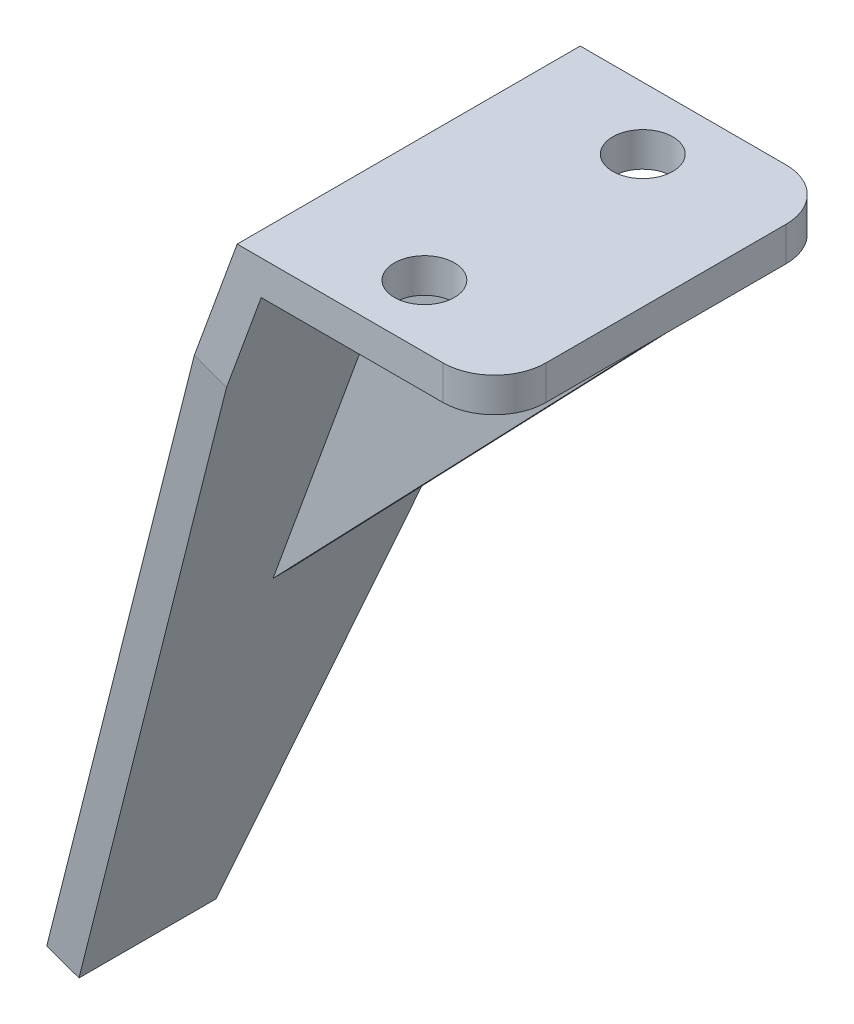
ISO-10303-21;
HEADER;
FILE_DESCRIPTION(('STEP AP214'),'2;1');
FILE_NAME('part.step','',(''),(''),'','','');
FILE_SCHEMA(('AUTOMOTIVE_DESIGN { 1 0 10303 214 1 1 1 1 }'));
ENDSEC;
DATA;
#1=APPLICATION_CONTEXT('core data for automotive mechanical design processes');
#2=APPLICATION_PROTOCOL_DEFINITION('international standard','automotive_design',2000,#1);
#3=PRODUCT_CONTEXT('',#1,'mechanical');
#4=PRODUCT('Part','Part','',(#3));
#5=PRODUCT_RELATED_PRODUCT_CATEGORY('part','',(#4));
#6=PRODUCT_DEFINITION_FORMATION('','',#4);
#7=PRODUCT_DEFINITION_CONTEXT('part definition',#1,'design');
#8=PRODUCT_DEFINITION('design','',#6,#7);
#9=PRODUCT_DEFINITION_SHAPE('','',#8);
#10=(LENGTH_UNIT() NAMED_UNIT(*) SI_UNIT(.MILLI.,.METRE.));
#11=(NAMED_UNIT(*) PLANE_ANGLE_UNIT() SI_UNIT($,.RADIAN.));
#12=(NAMED_UNIT(*) SI_UNIT($,.STERADIAN.) SOLID_ANGLE_UNIT());
#13=UNCERTAINTY_MEASURE_WITH_UNIT(LENGTH_MEASURE(1.E-05),#10,'distance_accuracy_value','');
#14=(GEOMETRIC_REPRESENTATION_CONTEXT(3) GLOBAL_UNCERTAINTY_ASSIGNED_CONTEXT((#13)) GLOBAL_UNIT_ASSIGNED_CONTEXT((#10,
#11,#12)) REPRESENTATION_CONTEXT('',''));
#15=CARTESIAN_POINT('',(0.,0.,0.));
#16=DIRECTION('',(0.,0.,1.));
#17=DIRECTION('',(1.,0.,0.));
#18=AXIS2_PLACEMENT_3D('',#15,#16,#17);
#19=CARTESIAN_POINT('',(22.7189077096569,22.1728559825543,10.));
#20=DIRECTION('',(0.,1.,0.));
#21=DIRECTION('',(0.,0.,1.));
#22=AXIS2_PLACEMENT_3D('',#19,#20,#21);
#23=PLANE('',#22);
#24=CARTESIAN_POINT('',(15.,22.1728559825543,-6.365));
#25=DIRECTION('',(0.,1.,0.));
#26=DIRECTION('',(0.,0.,1.));
#27=AXIS2_PLACEMENT_3D('',#24,#25,#26);
#28=CIRCLE('',#27,1.75);
#29=CARTESIAN_POINT('',(15.,22.1728559825543,-4.615));
#30=VERTEX_POINT('',#29);
#31=EDGE_CURVE('E175',#30,#30,#28,.T.);
#32=ORIENTED_EDGE('',*,*,#31,.T.);
#33=EDGE_LOOP('',(#32));
#34=FACE_BOUND('',#33,.T.);
#35=DIRECTION('',(1.,0.,0.));
#36=VECTOR('',#35,1.);
#37=CARTESIAN_POINT('',(22.7189077096569,22.1728559825543,-10.));
#38=LINE('',#37,#36);
#39=CARTESIAN_POINT('',(9.11932278607632,22.1728559825543,-10.));
#40=VERTEX_POINT('',#39);
#41=CARTESIAN_POINT('',(19.7189077096569,22.1728559825543,-10.));
#42=VERTEX_POINT('',#41);
#43=EDGE_CURVE('E193',#40,#42,#38,.T.);
#44=ORIENTED_EDGE('',*,*,#43,.T.);
#45=CARTESIAN_POINT('',(19.7189077096569,22.1728559825543,-7.));
#46=DIRECTION('',(0.,1.,0.));
#47=DIRECTION('',(0.,0.,1.));
#48=AXIS2_PLACEMENT_3D('',#45,#46,#47);
#49=CIRCLE('',#48,3.);
#50=CARTESIAN_POINT('',(22.7189077096569,22.1728559825543,-7.));
#51=VERTEX_POINT('',#50);
#52=EDGE_CURVE('E11',#42,#51,#49,.F.);
#53=ORIENTED_EDGE('',*,*,#52,.T.);
#54=DIRECTION('',(0.,0.,-1.));
#55=VECTOR('',#54,1.);
#56=CARTESIAN_POINT('',(22.7189077096569,22.1728559825543,10.));
#57=LINE('',#56,#55);
#58=CARTESIAN_POINT('',(22.7189077096569,22.1728559825543,0.));
#59=VERTEX_POINT('',#58);
#60=EDGE_CURVE('E144',#59,#51,#57,.T.);
#61=ORIENTED_EDGE('',*,*,#60,.F.);
#62=DIRECTION('',(-1.,0.,0.));
#63=VECTOR('',#62,1.);
#64=CARTESIAN_POINT('',(9.11932278607632,22.1728559825543,0.));
#65=LINE('',#64,#63);
#66=CARTESIAN_POINT('',(9.11932278607632,22.1728559825543,0.));
#67=VERTEX_POINT('',#66);
#68=EDGE_CURVE('E158',#59,#67,#65,.T.);
#69=ORIENTED_EDGE('',*,*,#68,.T.);
#70=DIRECTION('',(0.,0.,-1.));
#71=VECTOR('',#70,1.);
#72=CARTESIAN_POINT('',(9.11932278607632,22.1728559825543,10.));
#73=LINE('',#72,#71);
#74=EDGE_CURVE('E215',#67,#40,#73,.T.);
#75=ORIENTED_EDGE('',*,*,#74,.T.);
#76=EDGE_LOOP('',(#44,#53,#61,#69,#75));
#77=FACE_BOUND('',#76,.T.);
#78=ADVANCED_FACE('F45',(#34,#77),#23,.F.);
#79=CARTESIAN_POINT('',(22.7189077096569,24.1728559825543,10.));
#80=DIRECTION('',(-1.,0.,0.));
#81=DIRECTION('',(0.,0.,1.));
#82=AXIS2_PLACEMENT_3D('',#79,#80,#81);
#83=PLANE('',#82);
#84=DIRECTION('',(0.,0.,-1.));
#85=VECTOR('',#84,1.);
#86=CARTESIAN_POINT('',(22.7189077096569,24.1728559825543,10.));
#87=LINE('',#86,#85);
#88=CARTESIAN_POINT('',(22.7189077096569,24.1728559825543,7.));
#89=VERTEX_POINT('',#88);
#90=CARTESIAN_POINT('',(22.7189077096569,24.1728559825543,-7.));
#91=VERTEX_POINT('',#90);
#92=EDGE_CURVE('E232',#89,#91,#87,.T.);
#93=ORIENTED_EDGE('',*,*,#92,.F.);
#94=DIRECTION('',(0.,1.,0.));
#95=VECTOR('',#94,1.);
#96=CARTESIAN_POINT('',(22.7189077096569,24.1728559825543,7.));
#97=LINE('',#96,#95);
#98=CARTESIAN_POINT('',(22.7189077096569,22.1728559825543,7.));
#99=VERTEX_POINT('',#98);
#100=EDGE_CURVE('E279',#89,#99,#97,.F.);
#101=ORIENTED_EDGE('',*,*,#100,.T.);
#102=CARTESIAN_POINT('',(22.7189077096569,22.1728559825543,0.999999999999999));
#103=VERTEX_POINT('',#102);
#104=EDGE_CURVE('E147',#99,#103,#57,.T.);
#105=ORIENTED_EDGE('',*,*,#104,.T.);
#106=DIRECTION('',(0.,0.,-1.));
#107=VECTOR('',#106,1.);
#108=CARTESIAN_POINT('',(22.7189077096569,22.1728559825543,1.));
#109=LINE('',#108,#107);
#110=EDGE_CURVE('E140',#103,#59,#109,.T.);
#111=ORIENTED_EDGE('',*,*,#110,.T.);
#112=ORIENTED_EDGE('',*,*,#60,.T.);
#113=DIRECTION('',(0.,1.,0.));
#114=VECTOR('',#113,1.);
#115=CARTESIAN_POINT('',(22.7189077096569,24.1728559825543,-7.));
#116=LINE('',#115,#114);
#117=EDGE_CURVE('E276',#51,#91,#116,.T.);
#118=ORIENTED_EDGE('',*,*,#117,.T.);
#119=EDGE_LOOP('',(#93,#101,#105,#111,#112,#118));
#120=FACE_BOUND('',#119,.T.);
#121=ADVANCED_FACE('F142',(#120),#83,.F.);
#122=CARTESIAN_POINT('',(7.71890770965689,24.1728559825543,10.));
#123=DIRECTION('',(0.,-1.,0.));
#124=DIRECTION('',(1.,0.,0.));
#125=AXIS2_PLACEMENT_3D('',#122,#123,#124);
#126=PLANE('',#125);
#127=CARTESIAN_POINT('',(15.,24.1728559825543,-6.365));
#128=DIRECTION('',(0.,1.,0.));
#129=DIRECTION('',(-1.,0.,0.));
#130=AXIS2_PLACEMENT_3D('',#127,#128,#129);
#131=CIRCLE('',#130,1.75);
#132=CARTESIAN_POINT('',(13.25,24.1728559825543,-6.365));
#133=VERTEX_POINT('',#132);
#134=EDGE_CURVE('E266',#133,#133,#131,.T.);
#135=ORIENTED_EDGE('',*,*,#134,.F.);
#136=EDGE_LOOP('',(#135));
#137=FACE_BOUND('',#136,.T.);
#138=CARTESIAN_POINT('',(15.,24.1728559825543,6.365));
#139=DIRECTION('',(0.,1.,0.));
#140=DIRECTION('',(-1.,0.,0.));
#141=AXIS2_PLACEMENT_3D('',#138,#139,#140);
#142=CIRCLE('',#141,1.75);
#143=CARTESIAN_POINT('',(13.25,24.1728559825543,6.365));
#144=VERTEX_POINT('',#143);
#145=EDGE_CURVE('E296',#144,#144,#142,.T.);
#146=ORIENTED_EDGE('',*,*,#145,.F.);
#147=EDGE_LOOP('',(#146));
#148=FACE_BOUND('',#147,.T.);
#149=DIRECTION('',(-1.,0.,0.));
#150=VECTOR('',#149,1.);
#151=CARTESIAN_POINT('',(7.71890770965689,24.1728559825543,10.));
#152=LINE('',#151,#150);
#153=CARTESIAN_POINT('',(19.7189077096569,24.1728559825543,10.));
#154=VERTEX_POINT('',#153);
#155=CARTESIAN_POINT('',(7.71890770965689,24.1728559825543,10.));
#156=VERTEX_POINT('',#155);
#157=EDGE_CURVE('E189',#154,#156,#152,.T.);
#158=ORIENTED_EDGE('',*,*,#157,.F.);
#159=CARTESIAN_POINT('',(19.7189077096569,24.1728559825543,7.));
#160=DIRECTION('',(0.,-1.,0.));
#161=DIRECTION('',(1.,0.,0.));
#162=AXIS2_PLACEMENT_3D('',#159,#160,#161);
#163=CIRCLE('',#162,3.);
#164=EDGE_CURVE('E273',#154,#89,#163,.F.);
#165=ORIENTED_EDGE('',*,*,#164,.T.);
#166=ORIENTED_EDGE('',*,*,#92,.T.);
#167=CARTESIAN_POINT('',(19.7189077096569,24.1728559825543,-7.));
#168=DIRECTION('',(0.,-1.,0.));
#169=DIRECTION('',(1.,0.,0.));
#170=AXIS2_PLACEMENT_3D('',#167,#168,#169);
#171=CIRCLE('',#170,3.);
#172=CARTESIAN_POINT('',(19.7189077096569,24.1728559825543,-10.));
#173=VERTEX_POINT('',#172);
#174=EDGE_CURVE('E270',#91,#173,#171,.F.);
#175=ORIENTED_EDGE('',*,*,#174,.T.);
#176=DIRECTION('',(-1.,0.,0.));
#177=VECTOR('',#176,1.);
#178=CARTESIAN_POINT('',(7.71890770965689,24.1728559825543,-10.));
#179=LINE('',#178,#177);
#180=CARTESIAN_POINT('',(7.71890770965689,24.1728559825543,-10.));
#181=VERTEX_POINT('',#180);
#182=EDGE_CURVE('E188',#173,#181,#179,.T.);
#183=ORIENTED_EDGE('',*,*,#182,.T.);
#184=DIRECTION('',(0.,0.,-1.));
#185=VECTOR('',#184,1.);
#186=CARTESIAN_POINT('',(7.71890770965689,24.1728559825543,10.));
#187=LINE('',#186,#185);
#188=EDGE_CURVE('E228',#156,#181,#187,.T.);
#189=ORIENTED_EDGE('',*,*,#188,.F.);
#190=EDGE_LOOP('',(#158,#165,#166,#175,#183,#189));
#191=FACE_BOUND('',#190,.T.);
#192=ADVANCED_FACE('F307',(#137,#148,#191),#126,.F.);
#193=CARTESIAN_POINT('',(-9.38209945662673,-22.811775056741,10.));
#194=DIRECTION('',(0.939692620785907,-0.342020143325672,0.));
#195=DIRECTION('',(0.342020143325672,0.939692620785907,0.));
#196=AXIS2_PLACEMENT_3D('',#193,#194,#195);
#197=PLANE('',#196);
#198=DIRECTION('',(-0.342020143325672,-0.939692620785907,0.));
#199=VECTOR('',#198,1.);
#200=CARTESIAN_POINT('',(-9.38209945662673,-22.811775056741,-10.));
#201=LINE('',#200,#199);
#202=CARTESIAN_POINT('',(5.21949917696316,17.3057874769862,-10.));
#203=VERTEX_POINT('',#202);
#204=EDGE_CURVE('E205',#181,#203,#201,.T.);
#205=ORIENTED_EDGE('',*,*,#204,.T.);
#206=DIRECTION('',(-0.338691626801829,-0.930547596796365,0.139173100960066));
#207=VECTOR('',#206,1.);
#208=CARTESIAN_POINT('',(-9.38209945662673,-22.811775056741,-4.));
#209=LINE('',#208,#207);
#210=CARTESIAN_POINT('',(-9.38209945662673,-22.811775056741,-4.));
#211=VERTEX_POINT('',#210);
#212=EDGE_CURVE('E255',#203,#211,#209,.T.);
#213=ORIENTED_EDGE('',*,*,#212,.T.);
#214=DIRECTION('',(0.,0.,-1.));
#215=VECTOR('',#214,1.);
#216=CARTESIAN_POINT('',(-9.38209945662673,-22.811775056741,10.));
#217=LINE('',#216,#215);
#218=CARTESIAN_POINT('',(-9.38209945662673,-22.811775056741,4.));
#219=VERTEX_POINT('',#218);
#220=EDGE_CURVE('E224',#219,#211,#217,.T.);
#221=ORIENTED_EDGE('',*,*,#220,.F.);
#222=DIRECTION('',(-0.338691626801829,-0.930547596796365,-0.139173100960066));
#223=VECTOR('',#222,1.);
#224=CARTESIAN_POINT('',(5.21949917696314,17.3057874769862,10.));
#225=LINE('',#224,#223);
#226=CARTESIAN_POINT('',(5.21949917696314,17.3057874769862,10.));
#227=VERTEX_POINT('',#226);
#228=EDGE_CURVE('E252',#219,#227,#225,.F.);
#229=ORIENTED_EDGE('',*,*,#228,.T.);
#230=DIRECTION('',(-0.342020143325672,-0.939692620785907,0.));
#231=VECTOR('',#230,1.);
#232=CARTESIAN_POINT('',(-9.38209945662673,-22.811775056741,10.));
#233=LINE('',#232,#231);
#234=EDGE_CURVE('E192',#156,#227,#233,.T.);
#235=ORIENTED_EDGE('',*,*,#234,.F.);
#236=ORIENTED_EDGE('',*,*,#188,.T.);
#237=EDGE_LOOP('',(#205,#213,#221,#229,#235,#236));
#238=FACE_BOUND('',#237,.T.);
#239=ADVANCED_FACE('F310',(#238),#197,.F.);
#240=CARTESIAN_POINT('',(-7.50271421505492,-23.4958153433924,10.));
#241=DIRECTION('',(0.342020143325673,0.939692620785907,0.));
#242=DIRECTION('',(-0.939692620785907,0.342020143325673,0.));
#243=AXIS2_PLACEMENT_3D('',#240,#241,#242);
#244=PLANE('',#243);
#245=ORIENTED_EDGE('',*,*,#220,.T.);
#246=DIRECTION('',(0.939692620785907,-0.342020143325673,0.));
#247=VECTOR('',#246,1.);
#248=CARTESIAN_POINT('',(-7.50271421505492,-23.4958153433924,-4.));
#249=LINE('',#248,#247);
#250=CARTESIAN_POINT('',(-7.50271421505492,-23.4958153433924,-4.));
#251=VERTEX_POINT('',#250);
#252=EDGE_CURVE('E239',#211,#251,#249,.T.);
#253=ORIENTED_EDGE('',*,*,#252,.T.);
#254=DIRECTION('',(0.,0.,-1.));
#255=VECTOR('',#254,1.);
#256=CARTESIAN_POINT('',(-7.50271421505492,-23.4958153433924,10.));
#257=LINE('',#256,#255);
#258=CARTESIAN_POINT('',(-7.50271421505492,-23.4958153433924,4.));
#259=VERTEX_POINT('',#258);
#260=EDGE_CURVE('E220',#259,#251,#257,.T.);
#261=ORIENTED_EDGE('',*,*,#260,.F.);
#262=DIRECTION('',(-0.939692620785907,0.342020143325673,0.));
#263=VECTOR('',#262,1.);
#264=CARTESIAN_POINT('',(-7.50271421505492,-23.4958153433924,4.));
#265=LINE('',#264,#263);
#266=EDGE_CURVE('E236',#259,#219,#265,.T.);
#267=ORIENTED_EDGE('',*,*,#266,.T.);
#268=EDGE_LOOP('',(#245,#253,#261,#267));
#269=FACE_BOUND('',#268,.T.);
#270=ADVANCED_FACE('F345',(#269),#244,.F.);
#271=CARTESIAN_POINT('',(-7.50271421505492,-23.4958153433924,10.));
#272=DIRECTION('',(-0.939692620785907,0.342020143325673,0.));
#273=DIRECTION('',(-0.342020143325673,-0.939692620785907,0.));
#274=AXIS2_PLACEMENT_3D('',#271,#272,#273);
#275=PLANE('',#274);
#276=ORIENTED_EDGE('',*,*,#260,.T.);
#277=DIRECTION('',(0.338691626801829,0.930547596796365,-0.139173100960066));
#278=VECTOR('',#277,1.);
#279=CARTESIAN_POINT('',(-7.50271421505492,-23.4958153433924,-4.));
#280=LINE('',#279,#278);
#281=CARTESIAN_POINT('',(7.09888441853499,16.6217471903349,-10.));
#282=VERTEX_POINT('',#281);
#283=EDGE_CURVE('E246',#251,#282,#280,.T.);
#284=ORIENTED_EDGE('',*,*,#283,.T.);
#285=DIRECTION('',(0.342020143325673,0.939692620785907,0.));
#286=VECTOR('',#285,1.);
#287=CARTESIAN_POINT('',(-7.50271421505492,-23.4958153433924,-10.));
#288=LINE('',#287,#286);
#289=EDGE_CURVE('E209',#282,#40,#288,.T.);
#290=ORIENTED_EDGE('',*,*,#289,.T.);
#291=ORIENTED_EDGE('',*,*,#74,.F.);
#292=DIRECTION('',(-0.342020143325673,-0.939692620785907,0.));
#293=VECTOR('',#292,1.);
#294=CARTESIAN_POINT('',(0.808304285510699,-0.66147968041901,0.));
#295=LINE('',#294,#293);
#296=CARTESIAN_POINT('',(0.808304285510699,-0.661479680419009,0.));
#297=VERTEX_POINT('',#296);
#298=EDGE_CURVE('E171',#67,#297,#295,.T.);
#299=ORIENTED_EDGE('',*,*,#298,.T.);
#300=DIRECTION('',(0.,0.,-1.));
#301=VECTOR('',#300,1.);
#302=CARTESIAN_POINT('',(0.808304285510699,-0.66147968041901,1.));
#303=LINE('',#302,#301);
#304=CARTESIAN_POINT('',(0.808304285510699,-0.661479680419009,1.));
#305=VERTEX_POINT('',#304);
#306=EDGE_CURVE('E153',#305,#297,#303,.T.);
#307=ORIENTED_EDGE('',*,*,#306,.F.);
#308=DIRECTION('',(-0.342020143325673,-0.939692620785907,0.));
#309=VECTOR('',#308,1.);
#310=CARTESIAN_POINT('',(0.808304285510699,-0.66147968041901,1.));
#311=LINE('',#310,#309);
#312=CARTESIAN_POINT('',(9.11932278607632,22.1728559825543,0.999999999999999));
#313=VERTEX_POINT('',#312);
#314=EDGE_CURVE('E289',#313,#305,#311,.T.);
#315=ORIENTED_EDGE('',*,*,#314,.F.);
#316=CARTESIAN_POINT('',(9.11932278607632,22.1728559825543,10.));
#317=VERTEX_POINT('',#316);
#318=EDGE_CURVE('E216',#317,#313,#73,.T.);
#319=ORIENTED_EDGE('',*,*,#318,.F.);
#320=DIRECTION('',(0.342020143325673,0.939692620785907,0.));
#321=VECTOR('',#320,1.);
#322=CARTESIAN_POINT('',(-7.50271421505492,-23.4958153433924,10.));
#323=LINE('',#322,#321);
#324=CARTESIAN_POINT('',(7.09888441853497,16.6217471903348,10.));
#325=VERTEX_POINT('',#324);
#326=EDGE_CURVE('E197',#325,#317,#323,.T.);
#327=ORIENTED_EDGE('',*,*,#326,.F.);
#328=DIRECTION('',(0.338691626801829,0.930547596796365,0.139173100960066));
#329=VECTOR('',#328,1.);
#330=CARTESIAN_POINT('',(7.09888441853497,16.6217471903348,10.));
#331=LINE('',#330,#329);
#332=EDGE_CURVE('E243',#325,#259,#331,.F.);
#333=ORIENTED_EDGE('',*,*,#332,.T.);
#334=EDGE_LOOP('',(#276,#284,#290,#291,#299,#307,#315,#319,#327,#333));
#335=FACE_BOUND('',#334,.T.);
#336=ADVANCED_FACE('F331',(#335),#275,.F.);
#337=CARTESIAN_POINT('',(15.,22.1728559825543,6.365));
#338=DIRECTION('',(0.,1.,0.));
#339=DIRECTION('',(0.,0.,1.));
#340=AXIS2_PLACEMENT_3D('',#337,#338,#339);
#341=CIRCLE('',#340,1.75);
#342=CARTESIAN_POINT('',(15.,22.1728559825543,8.115));
#343=VERTEX_POINT('',#342);
#344=EDGE_CURVE('E181',#343,#343,#341,.T.);
#345=ORIENTED_EDGE('',*,*,#344,.T.);
#346=EDGE_LOOP('',(#345));
#347=FACE_BOUND('',#346,.T.);
#348=ORIENTED_EDGE('',*,*,#104,.F.);
#349=CARTESIAN_POINT('',(19.7189077096569,22.1728559825543,7.));
#350=DIRECTION('',(0.,1.,0.));
#351=DIRECTION('',(0.,0.,1.));
#352=AXIS2_PLACEMENT_3D('',#349,#350,#351);
#353=CIRCLE('',#352,3.);
#354=CARTESIAN_POINT('',(19.7189077096569,22.1728559825543,10.));
#355=VERTEX_POINT('',#354);
#356=EDGE_CURVE('E282',#99,#355,#353,.F.);
#357=ORIENTED_EDGE('',*,*,#356,.T.);
#358=DIRECTION('',(1.,0.,0.));
#359=VECTOR('',#358,1.);
#360=CARTESIAN_POINT('',(22.7189077096569,22.1728559825543,10.));
#361=LINE('',#360,#359);
#362=EDGE_CURVE('E161',#317,#355,#361,.T.);
#363=ORIENTED_EDGE('',*,*,#362,.F.);
#364=ORIENTED_EDGE('',*,*,#318,.T.);
#365=DIRECTION('',(-1.,0.,0.));
#366=VECTOR('',#365,1.);
#367=CARTESIAN_POINT('',(9.11932278607632,22.1728559825543,1.));
#368=LINE('',#367,#366);
#369=EDGE_CURVE('E170',#103,#313,#368,.T.);
#370=ORIENTED_EDGE('',*,*,#369,.F.);
#371=EDGE_LOOP('',(#348,#357,#363,#364,#370));
#372=FACE_BOUND('',#371,.T.);
#373=ADVANCED_FACE('F327',(#347,#372),#23,.F.);
#374=CARTESIAN_POINT('',(0.,0.,10.));
#375=DIRECTION('',(0.,0.,-1.));
#376=DIRECTION('',(-1.,0.,0.));
#377=AXIS2_PLACEMENT_3D('',#374,#375,#376);
#378=PLANE('',#377);
#379=ORIENTED_EDGE('',*,*,#362,.T.);
#380=DIRECTION('',(0.,1.,0.));
#381=VECTOR('',#380,1.);
#382=CARTESIAN_POINT('',(19.7189077096569,0.,10.));
#383=LINE('',#382,#381);
#384=EDGE_CURVE('E262',#355,#154,#383,.T.);
#385=ORIENTED_EDGE('',*,*,#384,.T.);
#386=ORIENTED_EDGE('',*,*,#157,.T.);
#387=ORIENTED_EDGE('',*,*,#234,.T.);
#388=DIRECTION('',(0.939692620785907,-0.342020143325673,0.));
#389=VECTOR('',#388,1.);
#390=CARTESIAN_POINT('',(6.17253830133088,16.9589096036252,10.));
#391=LINE('',#390,#389);
#392=EDGE_CURVE('E258',#227,#325,#391,.T.);
#393=ORIENTED_EDGE('',*,*,#392,.T.);
#394=ORIENTED_EDGE('',*,*,#326,.T.);
#395=EDGE_LOOP('',(#379,#385,#386,#387,#393,#394));
#396=FACE_BOUND('',#395,.T.);
#397=ADVANCED_FACE('F318',(#396),#378,.F.);
#398=CARTESIAN_POINT('',(0.,0.,-10.));
#399=DIRECTION('',(0.,0.,-1.));
#400=DIRECTION('',(-1.,0.,0.));
#401=AXIS2_PLACEMENT_3D('',#398,#399,#400);
#402=PLANE('',#401);
#403=ORIENTED_EDGE('',*,*,#182,.F.);
#404=DIRECTION('',(0.,1.,0.));
#405=VECTOR('',#404,1.);
#406=CARTESIAN_POINT('',(19.7189077096569,22.1728559825543,-10.));
#407=LINE('',#406,#405);
#408=EDGE_CURVE('E54',#173,#42,#407,.F.);
#409=ORIENTED_EDGE('',*,*,#408,.T.);
#410=ORIENTED_EDGE('',*,*,#43,.F.);
#411=ORIENTED_EDGE('',*,*,#289,.F.);
#412=DIRECTION('',(-0.939692620785907,0.342020143325673,0.));
#413=VECTOR('',#412,1.);
#414=CARTESIAN_POINT('',(5.21949917696318,17.3057874769862,-10.));
#415=LINE('',#414,#413);
#416=EDGE_CURVE('E249',#282,#203,#415,.T.);
#417=ORIENTED_EDGE('',*,*,#416,.T.);
#418=ORIENTED_EDGE('',*,*,#204,.F.);
#419=EDGE_LOOP('',(#403,#409,#410,#411,#417,#418));
#420=FACE_BOUND('',#419,.T.);
#421=ADVANCED_FACE('F334',(#420),#402,.T.);
#422=CARTESIAN_POINT('',(22.7189077096569,22.1728559825543,1.));
#423=DIRECTION('',(-0.721550830663219,0.692361465398833,0.));
#424=DIRECTION('',(-0.692361465398833,-0.721550830663219,0.));
#425=AXIS2_PLACEMENT_3D('',#422,#423,#424);
#426=PLANE('',#425);
#427=DIRECTION('',(0.692361465398832,0.721550830663219,0.));
#428=VECTOR('',#427,1.);
#429=CARTESIAN_POINT('',(22.7189077096569,22.1728559825543,0.));
#430=LINE('',#429,#428);
#431=EDGE_CURVE('E165',#297,#59,#430,.T.);
#432=ORIENTED_EDGE('',*,*,#431,.T.);
#433=ORIENTED_EDGE('',*,*,#110,.F.);
#434=DIRECTION('',(0.692361465398832,0.721550830663219,0.));
#435=VECTOR('',#434,1.);
#436=CARTESIAN_POINT('',(22.7189077096569,22.1728559825543,1.));
#437=LINE('',#436,#435);
#438=EDGE_CURVE('E154',#305,#103,#437,.T.);
#439=ORIENTED_EDGE('',*,*,#438,.F.);
#440=ORIENTED_EDGE('',*,*,#306,.T.);
#441=EDGE_LOOP('',(#432,#433,#439,#440));
#442=FACE_BOUND('',#441,.T.);
#443=ADVANCED_FACE('F166',(#442),#426,.F.);
#444=CARTESIAN_POINT('',(0.,0.,1.));
#445=DIRECTION('',(0.,0.,1.));
#446=DIRECTION('',(1.,0.,0.));
#447=AXIS2_PLACEMENT_3D('',#444,#445,#446);
#448=PLANE('',#447);
#449=ORIENTED_EDGE('',*,*,#369,.T.);
#450=ORIENTED_EDGE('',*,*,#314,.T.);
#451=ORIENTED_EDGE('',*,*,#438,.T.);
#452=EDGE_LOOP('',(#449,#450,#451));
#453=FACE_BOUND('',#452,.T.);
#454=ADVANCED_FACE('F329',(#453),#448,.T.);
#455=CARTESIAN_POINT('',(0.,0.,0.));
#456=DIRECTION('',(0.,0.,1.));
#457=DIRECTION('',(1.,0.,0.));
#458=AXIS2_PLACEMENT_3D('',#455,#456,#457);
#459=PLANE('',#458);
#460=ORIENTED_EDGE('',*,*,#68,.F.);
#461=ORIENTED_EDGE('',*,*,#431,.F.);
#462=ORIENTED_EDGE('',*,*,#298,.F.);
#463=EDGE_LOOP('',(#460,#461,#462));
#464=FACE_BOUND('',#463,.T.);
#465=ADVANCED_FACE('F173',(#464),#459,.F.);
#466=CARTESIAN_POINT('',(-7.50271421505492,-23.4958153433924,-4.));
#467=DIRECTION('',(-0.0476000039374402,-0.130779935984066,-0.99026806874157));
#468=DIRECTION('',(-0.939692620785907,0.342020143325673,0.));
#469=AXIS2_PLACEMENT_3D('',#466,#467,#468);
#470=PLANE('',#469);
#471=ORIENTED_EDGE('',*,*,#212,.F.);
#472=ORIENTED_EDGE('',*,*,#416,.F.);
#473=ORIENTED_EDGE('',*,*,#283,.F.);
#474=ORIENTED_EDGE('',*,*,#252,.F.);
#475=EDGE_LOOP('',(#471,#472,#473,#474));
#476=FACE_BOUND('',#475,.T.);
#477=ADVANCED_FACE('F339',(#476),#470,.T.);
#478=CARTESIAN_POINT('',(6.17253830133088,16.9589096036252,10.));
#479=DIRECTION('',(0.0476000039374402,0.130779935984066,-0.99026806874157));
#480=DIRECTION('',(0.939692620785907,-0.342020143325673,0.));
#481=AXIS2_PLACEMENT_3D('',#478,#479,#480);
#482=PLANE('',#481);
#483=ORIENTED_EDGE('',*,*,#228,.F.);
#484=ORIENTED_EDGE('',*,*,#266,.F.);
#485=ORIENTED_EDGE('',*,*,#332,.F.);
#486=ORIENTED_EDGE('',*,*,#392,.F.);
#487=EDGE_LOOP('',(#483,#484,#485,#486));
#488=FACE_BOUND('',#487,.T.);
#489=ADVANCED_FACE('F349',(#488),#482,.F.);
#490=CARTESIAN_POINT('',(15.,-23.4958153433924,6.365));
#491=DIRECTION('',(0.,1.,0.));
#492=DIRECTION('',(-1.,0.,0.));
#493=AXIS2_PLACEMENT_3D('',#490,#491,#492);
#494=CYLINDRICAL_SURFACE('',#493,1.75);
#495=ORIENTED_EDGE('',*,*,#145,.T.);
#496=EDGE_LOOP('',(#495));
#497=FACE_BOUND('',#496,.T.);
#498=ORIENTED_EDGE('',*,*,#344,.F.);
#499=EDGE_LOOP('',(#498));
#500=FACE_BOUND('',#499,.T.);
#501=ADVANCED_FACE('F373',(#497,#500),#494,.F.);
#502=CARTESIAN_POINT('',(15.,-23.4958153433924,-6.365));
#503=DIRECTION('',(0.,1.,0.));
#504=DIRECTION('',(-1.,0.,0.));
#505=AXIS2_PLACEMENT_3D('',#502,#503,#504);
#506=CYLINDRICAL_SURFACE('',#505,1.75);
#507=ORIENTED_EDGE('',*,*,#134,.T.);
#508=EDGE_LOOP('',(#507));
#509=FACE_BOUND('',#508,.T.);
#510=ORIENTED_EDGE('',*,*,#31,.F.);
#511=EDGE_LOOP('',(#510));
#512=FACE_BOUND('',#511,.T.);
#513=ADVANCED_FACE('F304',(#509,#512),#506,.F.);
#514=CARTESIAN_POINT('',(19.7189077096569,0.,7.));
#515=DIRECTION('',(0.,1.,0.));
#516=DIRECTION('',(0.,0.,1.));
#517=AXIS2_PLACEMENT_3D('',#514,#515,#516);
#518=CYLINDRICAL_SURFACE('',#517,3.);
#519=ORIENTED_EDGE('',*,*,#356,.F.);
#520=ORIENTED_EDGE('',*,*,#100,.F.);
#521=ORIENTED_EDGE('',*,*,#164,.F.);
#522=ORIENTED_EDGE('',*,*,#384,.F.);
#523=EDGE_LOOP('',(#519,#520,#521,#522));
#524=FACE_BOUND('',#523,.T.);
#525=ADVANCED_FACE('F324',(#524),#518,.T.);
#526=CARTESIAN_POINT('',(19.7189077096569,24.1728559825543,-7.));
#527=DIRECTION('',(0.,-1.,0.));
#528=DIRECTION('',(0.,0.,-1.));
#529=AXIS2_PLACEMENT_3D('',#526,#527,#528);
#530=CYLINDRICAL_SURFACE('',#529,3.);
#531=ORIENTED_EDGE('',*,*,#52,.F.);
#532=ORIENTED_EDGE('',*,*,#408,.F.);
#533=ORIENTED_EDGE('',*,*,#174,.F.);
#534=ORIENTED_EDGE('',*,*,#117,.F.);
#535=EDGE_LOOP('',(#531,#532,#533,#534));
#536=FACE_BOUND('',#535,.T.);
#537=ADVANCED_FACE('F47',(#536),#530,.T.);
#538=CLOSED_SHELL('',(#78,#121,#192,#239,#270,#336,#373,#397,#421,#443,#454,#465,#477,#489,#501,
#513,#525,#537));
#539=MANIFOLD_SOLID_BREP('B2',#538);
#540=ADVANCED_BREP_SHAPE_REPRESENTATION('',(#18,#539),#14);
#541=SHAPE_DEFINITION_REPRESENTATION(#9,#540);
ENDSEC;
END-ISO-10303-21;
